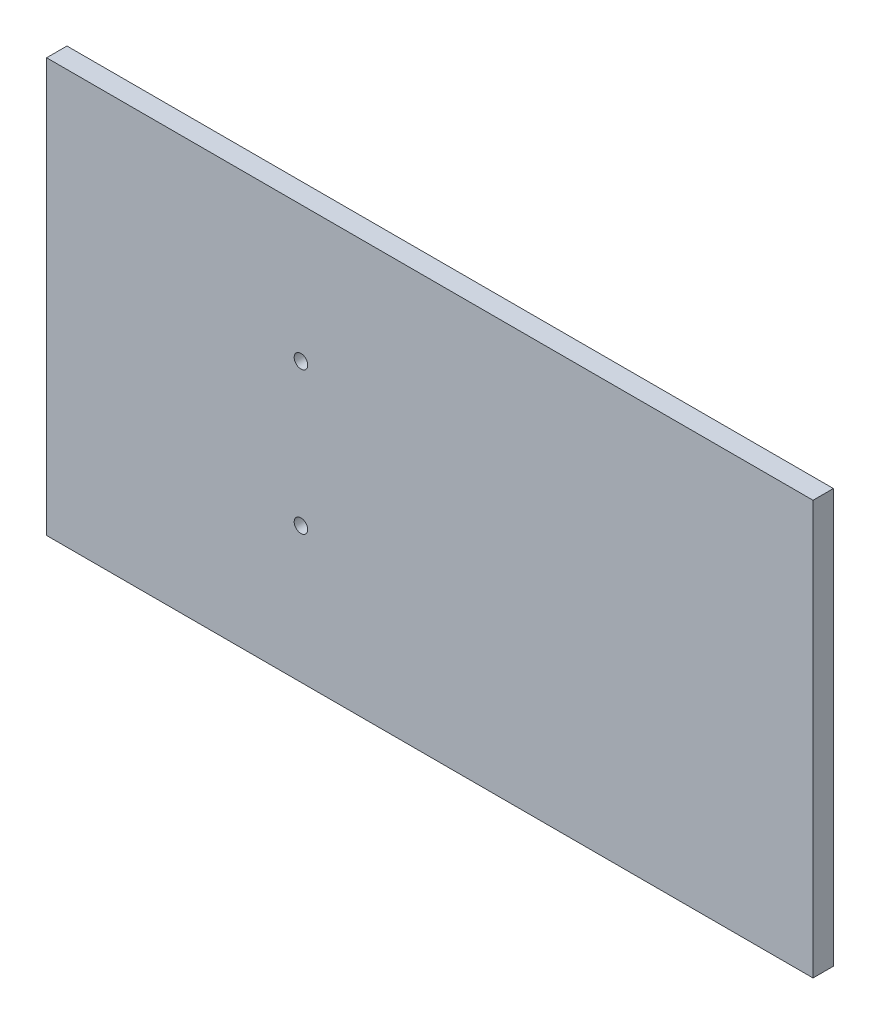
ISO-10303-21;
HEADER;
FILE_DESCRIPTION(('STEP AP214'),'2;1');
FILE_NAME('part.step','',(''),(''),'','','');
FILE_SCHEMA(('AUTOMOTIVE_DESIGN { 1 0 10303 214 1 1 1 1 }'));
ENDSEC;
DATA;
#1=APPLICATION_CONTEXT('core data for automotive mechanical design processes');
#2=APPLICATION_PROTOCOL_DEFINITION('international standard','automotive_design',2000,#1);
#3=PRODUCT_CONTEXT('',#1,'mechanical');
#4=PRODUCT('Part','Part','',(#3));
#5=PRODUCT_RELATED_PRODUCT_CATEGORY('part','',(#4));
#6=PRODUCT_DEFINITION_FORMATION('','',#4);
#7=PRODUCT_DEFINITION_CONTEXT('part definition',#1,'design');
#8=PRODUCT_DEFINITION('design','',#6,#7);
#9=PRODUCT_DEFINITION_SHAPE('','',#8);
#10=(LENGTH_UNIT() NAMED_UNIT(*) SI_UNIT(.MILLI.,.METRE.));
#11=(NAMED_UNIT(*) PLANE_ANGLE_UNIT() SI_UNIT($,.RADIAN.));
#12=(NAMED_UNIT(*) SI_UNIT($,.STERADIAN.) SOLID_ANGLE_UNIT());
#13=UNCERTAINTY_MEASURE_WITH_UNIT(LENGTH_MEASURE(1.E-05),#10,'distance_accuracy_value','');
#14=(GEOMETRIC_REPRESENTATION_CONTEXT(3) GLOBAL_UNCERTAINTY_ASSIGNED_CONTEXT((#13)) GLOBAL_UNIT_ASSIGNED_CONTEXT((#10,
#11,#12)) REPRESENTATION_CONTEXT('',''));
#15=CARTESIAN_POINT('',(0.,0.,0.));
#16=DIRECTION('',(0.,0.,1.));
#17=DIRECTION('',(1.,0.,0.));
#18=AXIS2_PLACEMENT_3D('',#15,#16,#17);
#19=CARTESIAN_POINT('',(0.,0.,3.));
#20=DIRECTION('',(0.,0.,1.));
#21=DIRECTION('',(1.,0.,0.));
#22=AXIS2_PLACEMENT_3D('',#19,#20,#21);
#23=PLANE('',#22);
#24=CARTESIAN_POINT('',(-75.5,41.,3.));
#25=DIRECTION('',(0.,0.,1.));
#26=DIRECTION('',(1.,0.,0.));
#27=AXIS2_PLACEMENT_3D('',#24,#25,#26);
#28=CIRCLE('',#27,0.999999999999998);
#29=CARTESIAN_POINT('',(-74.5,41.,3.));
#30=VERTEX_POINT('',#29);
#31=EDGE_CURVE('E99',#30,#30,#28,.T.);
#32=ORIENTED_EDGE('',*,*,#31,.F.);
#33=EDGE_LOOP('',(#32));
#34=FACE_BOUND('',#33,.T.);
#35=DIRECTION('',(0.,-1.,0.));
#36=VECTOR('',#35,1.);
#37=CARTESIAN_POINT('',(-113.,61.,3.));
#38=LINE('',#37,#36);
#39=CARTESIAN_POINT('',(-113.,61.,3.));
#40=VERTEX_POINT('',#39);
#41=CARTESIAN_POINT('',(-113.,0.,3.));
#42=VERTEX_POINT('',#41);
#43=EDGE_CURVE('E84',#40,#42,#38,.T.);
#44=ORIENTED_EDGE('',*,*,#43,.T.);
#45=DIRECTION('',(1.,0.,0.));
#46=VECTOR('',#45,1.);
#47=CARTESIAN_POINT('',(-113.,0.,3.));
#48=LINE('',#47,#46);
#49=CARTESIAN_POINT('',(0.,0.,3.));
#50=VERTEX_POINT('',#49);
#51=EDGE_CURVE('E79',#42,#50,#48,.T.);
#52=ORIENTED_EDGE('',*,*,#51,.T.);
#53=DIRECTION('',(0.,1.,0.));
#54=VECTOR('',#53,1.);
#55=CARTESIAN_POINT('',(0.,61.,3.));
#56=LINE('',#55,#54);
#57=CARTESIAN_POINT('',(0.,61.,3.));
#58=VERTEX_POINT('',#57);
#59=EDGE_CURVE('E82',#50,#58,#56,.T.);
#60=ORIENTED_EDGE('',*,*,#59,.T.);
#61=DIRECTION('',(-1.,0.,0.));
#62=VECTOR('',#61,1.);
#63=CARTESIAN_POINT('',(-113.,61.,3.));
#64=LINE('',#63,#62);
#65=EDGE_CURVE('E49',#58,#40,#64,.T.);
#66=ORIENTED_EDGE('',*,*,#65,.T.);
#67=EDGE_LOOP('',(#44,#52,#60,#66));
#68=FACE_BOUND('',#67,.T.);
#69=CARTESIAN_POINT('',(-75.5,20.,3.));
#70=DIRECTION('',(0.,0.,1.));
#71=DIRECTION('',(1.,0.,0.));
#72=AXIS2_PLACEMENT_3D('',#69,#70,#71);
#73=CIRCLE('',#72,0.999999999999998);
#74=CARTESIAN_POINT('',(-74.5,20.,3.));
#75=VERTEX_POINT('',#74);
#76=EDGE_CURVE('E114',#75,#75,#73,.T.);
#77=ORIENTED_EDGE('',*,*,#76,.F.);
#78=EDGE_LOOP('',(#77));
#79=FACE_BOUND('',#78,.T.);
#80=ADVANCED_FACE('F32',(#34,#68,#79),#23,.T.);
#81=CARTESIAN_POINT('',(0.,0.,0.));
#82=DIRECTION('',(0.,0.,1.));
#83=DIRECTION('',(1.,0.,0.));
#84=AXIS2_PLACEMENT_3D('',#81,#82,#83);
#85=PLANE('',#84);
#86=CARTESIAN_POINT('',(-75.5,41.,0.));
#87=DIRECTION('',(0.,0.,1.));
#88=DIRECTION('',(1.,0.,0.));
#89=AXIS2_PLACEMENT_3D('',#86,#87,#88);
#90=CIRCLE('',#89,0.999999999999998);
#91=CARTESIAN_POINT('',(-74.5,41.,0.));
#92=VERTEX_POINT('',#91);
#93=EDGE_CURVE('E111',#92,#92,#90,.T.);
#94=ORIENTED_EDGE('',*,*,#93,.T.);
#95=EDGE_LOOP('',(#94));
#96=FACE_BOUND('',#95,.T.);
#97=DIRECTION('',(0.,-1.,0.));
#98=VECTOR('',#97,1.);
#99=CARTESIAN_POINT('',(-113.,61.,0.));
#100=LINE('',#99,#98);
#101=CARTESIAN_POINT('',(-113.,61.,0.));
#102=VERTEX_POINT('',#101);
#103=CARTESIAN_POINT('',(-113.,0.,0.));
#104=VERTEX_POINT('',#103);
#105=EDGE_CURVE('E96',#102,#104,#100,.T.);
#106=ORIENTED_EDGE('',*,*,#105,.F.);
#107=DIRECTION('',(-1.,0.,0.));
#108=VECTOR('',#107,1.);
#109=CARTESIAN_POINT('',(-113.,61.,0.));
#110=LINE('',#109,#108);
#111=CARTESIAN_POINT('',(0.,61.,0.));
#112=VERTEX_POINT('',#111);
#113=EDGE_CURVE('E72',#112,#102,#110,.T.);
#114=ORIENTED_EDGE('',*,*,#113,.F.);
#115=DIRECTION('',(0.,1.,0.));
#116=VECTOR('',#115,1.);
#117=CARTESIAN_POINT('',(0.,61.,0.));
#118=LINE('',#117,#116);
#119=CARTESIAN_POINT('',(0.,0.,0.));
#120=VERTEX_POINT('',#119);
#121=EDGE_CURVE('E66',#120,#112,#118,.T.);
#122=ORIENTED_EDGE('',*,*,#121,.F.);
#123=DIRECTION('',(1.,0.,0.));
#124=VECTOR('',#123,1.);
#125=CARTESIAN_POINT('',(-113.,0.,0.));
#126=LINE('',#125,#124);
#127=EDGE_CURVE('E88',#104,#120,#126,.T.);
#128=ORIENTED_EDGE('',*,*,#127,.F.);
#129=EDGE_LOOP('',(#106,#114,#122,#128));
#130=FACE_BOUND('',#129,.T.);
#131=CARTESIAN_POINT('',(-75.5,20.,0.));
#132=DIRECTION('',(0.,0.,1.));
#133=DIRECTION('',(1.,0.,0.));
#134=AXIS2_PLACEMENT_3D('',#131,#132,#133);
#135=CIRCLE('',#134,0.999999999999998);
#136=CARTESIAN_POINT('',(-74.5,20.,0.));
#137=VERTEX_POINT('',#136);
#138=EDGE_CURVE('E117',#137,#137,#135,.T.);
#139=ORIENTED_EDGE('',*,*,#138,.T.);
#140=EDGE_LOOP('',(#139));
#141=FACE_BOUND('',#140,.T.);
#142=ADVANCED_FACE('F107',(#96,#130,#141),#85,.F.);
#143=CARTESIAN_POINT('',(-113.,61.,3.));
#144=DIRECTION('',(1.,0.,0.));
#145=DIRECTION('',(0.,1.,0.));
#146=AXIS2_PLACEMENT_3D('',#143,#144,#145);
#147=PLANE('',#146);
#148=ORIENTED_EDGE('',*,*,#105,.T.);
#149=DIRECTION('',(0.,0.,-1.));
#150=VECTOR('',#149,1.);
#151=CARTESIAN_POINT('',(-113.,0.,3.));
#152=LINE('',#151,#150);
#153=EDGE_CURVE('E11',#42,#104,#152,.T.);
#154=ORIENTED_EDGE('',*,*,#153,.F.);
#155=ORIENTED_EDGE('',*,*,#43,.F.);
#156=DIRECTION('',(0.,0.,-1.));
#157=VECTOR('',#156,1.);
#158=CARTESIAN_POINT('',(-113.,61.,3.));
#159=LINE('',#158,#157);
#160=EDGE_CURVE('E92',#40,#102,#159,.T.);
#161=ORIENTED_EDGE('',*,*,#160,.T.);
#162=EDGE_LOOP('',(#148,#154,#155,#161));
#163=FACE_BOUND('',#162,.T.);
#164=ADVANCED_FACE('F34',(#163),#147,.F.);
#165=CARTESIAN_POINT('',(-113.,0.,3.));
#166=DIRECTION('',(0.,1.,0.));
#167=DIRECTION('',(0.,0.,1.));
#168=AXIS2_PLACEMENT_3D('',#165,#166,#167);
#169=PLANE('',#168);
#170=ORIENTED_EDGE('',*,*,#127,.T.);
#171=DIRECTION('',(0.,0.,-1.));
#172=VECTOR('',#171,1.);
#173=CARTESIAN_POINT('',(0.,0.,3.));
#174=LINE('',#173,#172);
#175=EDGE_CURVE('E41',#50,#120,#174,.T.);
#176=ORIENTED_EDGE('',*,*,#175,.F.);
#177=ORIENTED_EDGE('',*,*,#51,.F.);
#178=ORIENTED_EDGE('',*,*,#153,.T.);
#179=EDGE_LOOP('',(#170,#176,#177,#178));
#180=FACE_BOUND('',#179,.T.);
#181=ADVANCED_FACE('F87',(#180),#169,.F.);
#182=CARTESIAN_POINT('',(0.,61.,3.));
#183=DIRECTION('',(-1.,0.,0.));
#184=DIRECTION('',(0.,0.,1.));
#185=AXIS2_PLACEMENT_3D('',#182,#183,#184);
#186=PLANE('',#185);
#187=ORIENTED_EDGE('',*,*,#121,.T.);
#188=DIRECTION('',(0.,0.,-1.));
#189=VECTOR('',#188,1.);
#190=CARTESIAN_POINT('',(0.,61.,3.));
#191=LINE('',#190,#189);
#192=EDGE_CURVE('E89',#58,#112,#191,.T.);
#193=ORIENTED_EDGE('',*,*,#192,.F.);
#194=ORIENTED_EDGE('',*,*,#59,.F.);
#195=ORIENTED_EDGE('',*,*,#175,.T.);
#196=EDGE_LOOP('',(#187,#193,#194,#195));
#197=FACE_BOUND('',#196,.T.);
#198=ADVANCED_FACE('F90',(#197),#186,.F.);
#199=CARTESIAN_POINT('',(-113.,61.,3.));
#200=DIRECTION('',(0.,-1.,0.));
#201=DIRECTION('',(1.,0.,0.));
#202=AXIS2_PLACEMENT_3D('',#199,#200,#201);
#203=PLANE('',#202);
#204=ORIENTED_EDGE('',*,*,#113,.T.);
#205=ORIENTED_EDGE('',*,*,#160,.F.);
#206=ORIENTED_EDGE('',*,*,#65,.F.);
#207=ORIENTED_EDGE('',*,*,#192,.T.);
#208=EDGE_LOOP('',(#204,#205,#206,#207));
#209=FACE_BOUND('',#208,.T.);
#210=ADVANCED_FACE('F104',(#209),#203,.F.);
#211=CARTESIAN_POINT('',(-75.5,41.,3.));
#212=DIRECTION('',(0.,0.,-1.));
#213=DIRECTION('',(-1.,0.,0.));
#214=AXIS2_PLACEMENT_3D('',#211,#212,#213);
#215=CYLINDRICAL_SURFACE('',#214,0.999999999999998);
#216=ORIENTED_EDGE('',*,*,#31,.T.);
#217=EDGE_LOOP('',(#216));
#218=FACE_BOUND('',#217,.T.);
#219=ORIENTED_EDGE('',*,*,#93,.F.);
#220=EDGE_LOOP('',(#219));
#221=FACE_BOUND('',#220,.T.);
#222=ADVANCED_FACE('F135',(#218,#221),#215,.F.);
#223=CARTESIAN_POINT('',(-75.5,20.,3.));
#224=DIRECTION('',(0.,0.,-1.));
#225=DIRECTION('',(-1.,0.,0.));
#226=AXIS2_PLACEMENT_3D('',#223,#224,#225);
#227=CYLINDRICAL_SURFACE('',#226,0.999999999999998);
#228=ORIENTED_EDGE('',*,*,#76,.T.);
#229=EDGE_LOOP('',(#228));
#230=FACE_BOUND('',#229,.T.);
#231=ORIENTED_EDGE('',*,*,#138,.F.);
#232=EDGE_LOOP('',(#231));
#233=FACE_BOUND('',#232,.T.);
#234=ADVANCED_FACE('F123',(#230,#233),#227,.F.);
#235=CLOSED_SHELL('',(#80,#142,#164,#181,#198,#210,#222,#234));
#236=MANIFOLD_SOLID_BREP('B2',#235);
#237=ADVANCED_BREP_SHAPE_REPRESENTATION('',(#18,#236),#14);
#238=SHAPE_DEFINITION_REPRESENTATION(#9,#237);
ENDSEC;
END-ISO-10303-21;
